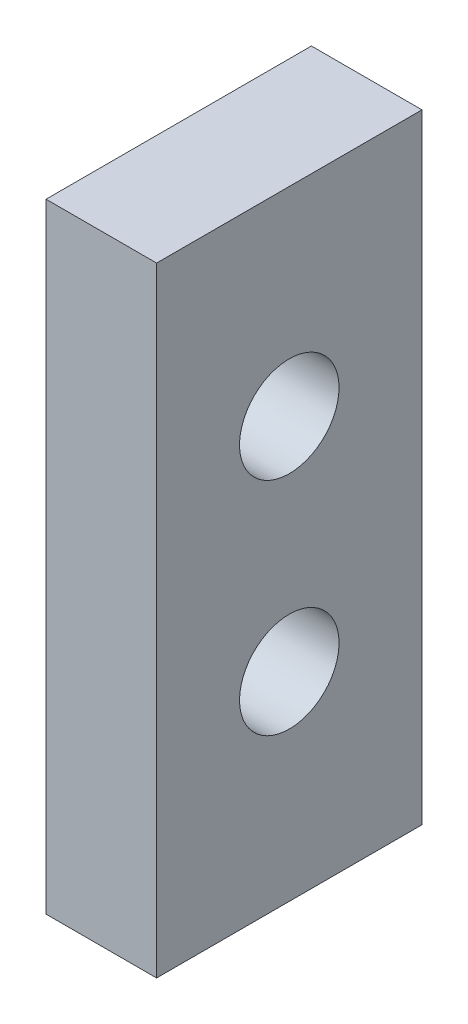
ISO-10303-21;
HEADER;
FILE_DESCRIPTION(('STEP AP214'),'2;1');
FILE_NAME('part.step','',(''),(''),'','','');
FILE_SCHEMA(('AUTOMOTIVE_DESIGN { 1 0 10303 214 1 1 1 1 }'));
ENDSEC;
DATA;
#1=APPLICATION_CONTEXT('core data for automotive mechanical design processes');
#2=APPLICATION_PROTOCOL_DEFINITION('international standard','automotive_design',2000,#1);
#3=PRODUCT_CONTEXT('',#1,'mechanical');
#4=PRODUCT('Part','Part','',(#3));
#5=PRODUCT_RELATED_PRODUCT_CATEGORY('part','',(#4));
#6=PRODUCT_DEFINITION_FORMATION('','',#4);
#7=PRODUCT_DEFINITION_CONTEXT('part definition',#1,'design');
#8=PRODUCT_DEFINITION('design','',#6,#7);
#9=PRODUCT_DEFINITION_SHAPE('','',#8);
#10=(LENGTH_UNIT() NAMED_UNIT(*) SI_UNIT(.MILLI.,.METRE.));
#11=(NAMED_UNIT(*) PLANE_ANGLE_UNIT() SI_UNIT($,.RADIAN.));
#12=(NAMED_UNIT(*) SI_UNIT($,.STERADIAN.) SOLID_ANGLE_UNIT());
#13=UNCERTAINTY_MEASURE_WITH_UNIT(LENGTH_MEASURE(1.E-05),#10,'distance_accuracy_value','');
#14=(GEOMETRIC_REPRESENTATION_CONTEXT(3) GLOBAL_UNCERTAINTY_ASSIGNED_CONTEXT((#13)) GLOBAL_UNIT_ASSIGNED_CONTEXT((#10,
#11,#12)) REPRESENTATION_CONTEXT('',''));
#15=CARTESIAN_POINT('',(0.,0.,0.));
#16=DIRECTION('',(0.,0.,1.));
#17=DIRECTION('',(1.,0.,0.));
#18=AXIS2_PLACEMENT_3D('',#15,#16,#17);
#19=CARTESIAN_POINT('',(5.,0.,0.));
#20=DIRECTION('',(1.,0.,0.));
#21=DIRECTION('',(0.,0.,-1.));
#22=AXIS2_PLACEMENT_3D('',#19,#20,#21);
#23=PLANE('',#22);
#24=CARTESIAN_POINT('',(5.,5.,0.));
#25=DIRECTION('',(1.,0.,0.));
#26=DIRECTION('',(0.,0.,-1.));
#27=AXIS2_PLACEMENT_3D('',#24,#25,#26);
#28=CIRCLE('',#27,2.25);
#29=CARTESIAN_POINT('',(5.,5.,-2.25));
#30=VERTEX_POINT('',#29);
#31=EDGE_CURVE('E100',#30,#30,#28,.T.);
#32=ORIENTED_EDGE('',*,*,#31,.F.);
#33=EDGE_LOOP('',(#32));
#34=FACE_BOUND('',#33,.T.);
#35=DIRECTION('',(0.,-1.,0.));
#36=VECTOR('',#35,1.);
#37=CARTESIAN_POINT('',(5.,-14.,6.));
#38=LINE('',#37,#36);
#39=CARTESIAN_POINT('',(5.,14.,6.));
#40=VERTEX_POINT('',#39);
#41=CARTESIAN_POINT('',(5.,-14.,6.));
#42=VERTEX_POINT('',#41);
#43=EDGE_CURVE('E85',#40,#42,#38,.T.);
#44=ORIENTED_EDGE('',*,*,#43,.T.);
#45=DIRECTION('',(0.,0.,-1.));
#46=VECTOR('',#45,1.);
#47=CARTESIAN_POINT('',(5.,-14.,-6.));
#48=LINE('',#47,#46);
#49=CARTESIAN_POINT('',(5.,-14.,-6.));
#50=VERTEX_POINT('',#49);
#51=EDGE_CURVE('E80',#42,#50,#48,.T.);
#52=ORIENTED_EDGE('',*,*,#51,.T.);
#53=DIRECTION('',(0.,1.,0.));
#54=VECTOR('',#53,1.);
#55=CARTESIAN_POINT('',(5.,-14.,-6.));
#56=LINE('',#55,#54);
#57=CARTESIAN_POINT('',(5.,14.,-6.));
#58=VERTEX_POINT('',#57);
#59=EDGE_CURVE('E83',#50,#58,#56,.T.);
#60=ORIENTED_EDGE('',*,*,#59,.T.);
#61=DIRECTION('',(0.,0.,1.));
#62=VECTOR('',#61,1.);
#63=CARTESIAN_POINT('',(5.,14.,-6.));
#64=LINE('',#63,#62);
#65=EDGE_CURVE('E50',#58,#40,#64,.T.);
#66=ORIENTED_EDGE('',*,*,#65,.T.);
#67=EDGE_LOOP('',(#44,#52,#60,#66));
#68=FACE_BOUND('',#67,.T.);
#69=CARTESIAN_POINT('',(5.,-5.,0.));
#70=DIRECTION('',(1.,0.,0.));
#71=DIRECTION('',(0.,0.,1.));
#72=AXIS2_PLACEMENT_3D('',#69,#70,#71);
#73=CIRCLE('',#72,2.25);
#74=CARTESIAN_POINT('',(5.,-5.,2.25));
#75=VERTEX_POINT('',#74);
#76=EDGE_CURVE('E115',#75,#75,#73,.T.);
#77=ORIENTED_EDGE('',*,*,#76,.F.);
#78=EDGE_LOOP('',(#77));
#79=FACE_BOUND('',#78,.T.);
#80=ADVANCED_FACE('F33',(#34,#68,#79),#23,.T.);
#81=CARTESIAN_POINT('',(0.,0.,0.));
#82=DIRECTION('',(1.,0.,0.));
#83=DIRECTION('',(0.,0.,-1.));
#84=AXIS2_PLACEMENT_3D('',#81,#82,#83);
#85=PLANE('',#84);
#86=DIRECTION('',(0.,-1.,0.));
#87=VECTOR('',#86,1.);
#88=CARTESIAN_POINT('',(0.,-14.,6.));
#89=LINE('',#88,#87);
#90=CARTESIAN_POINT('',(0.,14.,6.));
#91=VERTEX_POINT('',#90);
#92=CARTESIAN_POINT('',(0.,-14.,6.));
#93=VERTEX_POINT('',#92);
#94=EDGE_CURVE('E97',#91,#93,#89,.T.);
#95=ORIENTED_EDGE('',*,*,#94,.F.);
#96=DIRECTION('',(0.,0.,1.));
#97=VECTOR('',#96,1.);
#98=CARTESIAN_POINT('',(0.,14.,-6.));
#99=LINE('',#98,#97);
#100=CARTESIAN_POINT('',(0.,14.,-6.));
#101=VERTEX_POINT('',#100);
#102=EDGE_CURVE('E73',#101,#91,#99,.T.);
#103=ORIENTED_EDGE('',*,*,#102,.F.);
#104=DIRECTION('',(0.,1.,0.));
#105=VECTOR('',#104,1.);
#106=CARTESIAN_POINT('',(0.,-14.,-6.));
#107=LINE('',#106,#105);
#108=CARTESIAN_POINT('',(0.,-14.,-6.));
#109=VERTEX_POINT('',#108);
#110=EDGE_CURVE('E67',#109,#101,#107,.T.);
#111=ORIENTED_EDGE('',*,*,#110,.F.);
#112=DIRECTION('',(0.,0.,-1.));
#113=VECTOR('',#112,1.);
#114=CARTESIAN_POINT('',(0.,-14.,-6.));
#115=LINE('',#114,#113);
#116=EDGE_CURVE('E89',#93,#109,#115,.T.);
#117=ORIENTED_EDGE('',*,*,#116,.F.);
#118=EDGE_LOOP('',(#95,#103,#111,#117));
#119=FACE_BOUND('',#118,.T.);
#120=CARTESIAN_POINT('',(0.,5.,0.));
#121=DIRECTION('',(1.,0.,0.));
#122=DIRECTION('',(0.,0.,-1.));
#123=AXIS2_PLACEMENT_3D('',#120,#121,#122);
#124=CIRCLE('',#123,2.25);
#125=CARTESIAN_POINT('',(0.,5.,-2.25));
#126=VERTEX_POINT('',#125);
#127=EDGE_CURVE('E112',#126,#126,#124,.T.);
#128=ORIENTED_EDGE('',*,*,#127,.T.);
#129=EDGE_LOOP('',(#128));
#130=FACE_BOUND('',#129,.T.);
#131=CARTESIAN_POINT('',(0.,-5.,0.));
#132=DIRECTION('',(1.,0.,0.));
#133=DIRECTION('',(0.,0.,1.));
#134=AXIS2_PLACEMENT_3D('',#131,#132,#133);
#135=CIRCLE('',#134,2.25);
#136=CARTESIAN_POINT('',(0.,-5.,2.25));
#137=VERTEX_POINT('',#136);
#138=EDGE_CURVE('E118',#137,#137,#135,.T.);
#139=ORIENTED_EDGE('',*,*,#138,.T.);
#140=EDGE_LOOP('',(#139));
#141=FACE_BOUND('',#140,.T.);
#142=ADVANCED_FACE('F108',(#119,#130,#141),#85,.F.);
#143=CARTESIAN_POINT('',(5.,-14.,6.));
#144=DIRECTION('',(0.,0.,-1.));
#145=DIRECTION('',(-1.,0.,0.));
#146=AXIS2_PLACEMENT_3D('',#143,#144,#145);
#147=PLANE('',#146);
#148=ORIENTED_EDGE('',*,*,#94,.T.);
#149=DIRECTION('',(-1.,0.,0.));
#150=VECTOR('',#149,1.);
#151=CARTESIAN_POINT('',(5.,-14.,6.));
#152=LINE('',#151,#150);
#153=EDGE_CURVE('E11',#42,#93,#152,.T.);
#154=ORIENTED_EDGE('',*,*,#153,.F.);
#155=ORIENTED_EDGE('',*,*,#43,.F.);
#156=DIRECTION('',(-1.,0.,0.));
#157=VECTOR('',#156,1.);
#158=CARTESIAN_POINT('',(5.,14.,6.));
#159=LINE('',#158,#157);
#160=EDGE_CURVE('E93',#40,#91,#159,.T.);
#161=ORIENTED_EDGE('',*,*,#160,.T.);
#162=EDGE_LOOP('',(#148,#154,#155,#161));
#163=FACE_BOUND('',#162,.T.);
#164=ADVANCED_FACE('F35',(#163),#147,.F.);
#165=CARTESIAN_POINT('',(5.,-14.,-6.));
#166=DIRECTION('',(0.,1.,0.));
#167=DIRECTION('',(0.,0.,1.));
#168=AXIS2_PLACEMENT_3D('',#165,#166,#167);
#169=PLANE('',#168);
#170=ORIENTED_EDGE('',*,*,#116,.T.);
#171=DIRECTION('',(-1.,0.,0.));
#172=VECTOR('',#171,1.);
#173=CARTESIAN_POINT('',(5.,-14.,-6.));
#174=LINE('',#173,#172);
#175=EDGE_CURVE('E42',#50,#109,#174,.T.);
#176=ORIENTED_EDGE('',*,*,#175,.F.);
#177=ORIENTED_EDGE('',*,*,#51,.F.);
#178=ORIENTED_EDGE('',*,*,#153,.T.);
#179=EDGE_LOOP('',(#170,#176,#177,#178));
#180=FACE_BOUND('',#179,.T.);
#181=ADVANCED_FACE('F88',(#180),#169,.F.);
#182=CARTESIAN_POINT('',(5.,-14.,-6.));
#183=DIRECTION('',(0.,0.,1.));
#184=DIRECTION('',(1.,0.,0.));
#185=AXIS2_PLACEMENT_3D('',#182,#183,#184);
#186=PLANE('',#185);
#187=ORIENTED_EDGE('',*,*,#110,.T.);
#188=DIRECTION('',(-1.,0.,0.));
#189=VECTOR('',#188,1.);
#190=CARTESIAN_POINT('',(5.,14.,-6.));
#191=LINE('',#190,#189);
#192=EDGE_CURVE('E90',#58,#101,#191,.T.);
#193=ORIENTED_EDGE('',*,*,#192,.F.);
#194=ORIENTED_EDGE('',*,*,#59,.F.);
#195=ORIENTED_EDGE('',*,*,#175,.T.);
#196=EDGE_LOOP('',(#187,#193,#194,#195));
#197=FACE_BOUND('',#196,.T.);
#198=ADVANCED_FACE('F91',(#197),#186,.F.);
#199=CARTESIAN_POINT('',(5.,14.,-6.));
#200=DIRECTION('',(0.,-1.,0.));
#201=DIRECTION('',(0.,0.,-1.));
#202=AXIS2_PLACEMENT_3D('',#199,#200,#201);
#203=PLANE('',#202);
#204=ORIENTED_EDGE('',*,*,#102,.T.);
#205=ORIENTED_EDGE('',*,*,#160,.F.);
#206=ORIENTED_EDGE('',*,*,#65,.F.);
#207=ORIENTED_EDGE('',*,*,#192,.T.);
#208=EDGE_LOOP('',(#204,#205,#206,#207));
#209=FACE_BOUND('',#208,.T.);
#210=ADVANCED_FACE('F105',(#209),#203,.F.);
#211=CARTESIAN_POINT('',(5.,5.,0.));
#212=DIRECTION('',(-1.,0.,0.));
#213=DIRECTION('',(0.,0.,1.));
#214=AXIS2_PLACEMENT_3D('',#211,#212,#213);
#215=CYLINDRICAL_SURFACE('',#214,2.25);
#216=ORIENTED_EDGE('',*,*,#31,.T.);
#217=EDGE_LOOP('',(#216));
#218=FACE_BOUND('',#217,.T.);
#219=ORIENTED_EDGE('',*,*,#127,.F.);
#220=EDGE_LOOP('',(#219));
#221=FACE_BOUND('',#220,.T.);
#222=ADVANCED_FACE('F135',(#218,#221),#215,.F.);
#223=CARTESIAN_POINT('',(5.,-5.,0.));
#224=DIRECTION('',(-1.,0.,0.));
#225=DIRECTION('',(0.,0.,1.));
#226=AXIS2_PLACEMENT_3D('',#223,#224,#225);
#227=CYLINDRICAL_SURFACE('',#226,2.25);
#228=ORIENTED_EDGE('',*,*,#76,.T.);
#229=EDGE_LOOP('',(#228));
#230=FACE_BOUND('',#229,.T.);
#231=ORIENTED_EDGE('',*,*,#138,.F.);
#232=EDGE_LOOP('',(#231));
#233=FACE_BOUND('',#232,.T.);
#234=ADVANCED_FACE('F124',(#230,#233),#227,.F.);
#235=CLOSED_SHELL('',(#80,#142,#164,#181,#198,#210,#222,#234));
#236=MANIFOLD_SOLID_BREP('B2',#235);
#237=ADVANCED_BREP_SHAPE_REPRESENTATION('',(#18,#236),#14);
#238=SHAPE_DEFINITION_REPRESENTATION(#9,#237);
ENDSEC;
END-ISO-10303-21;
